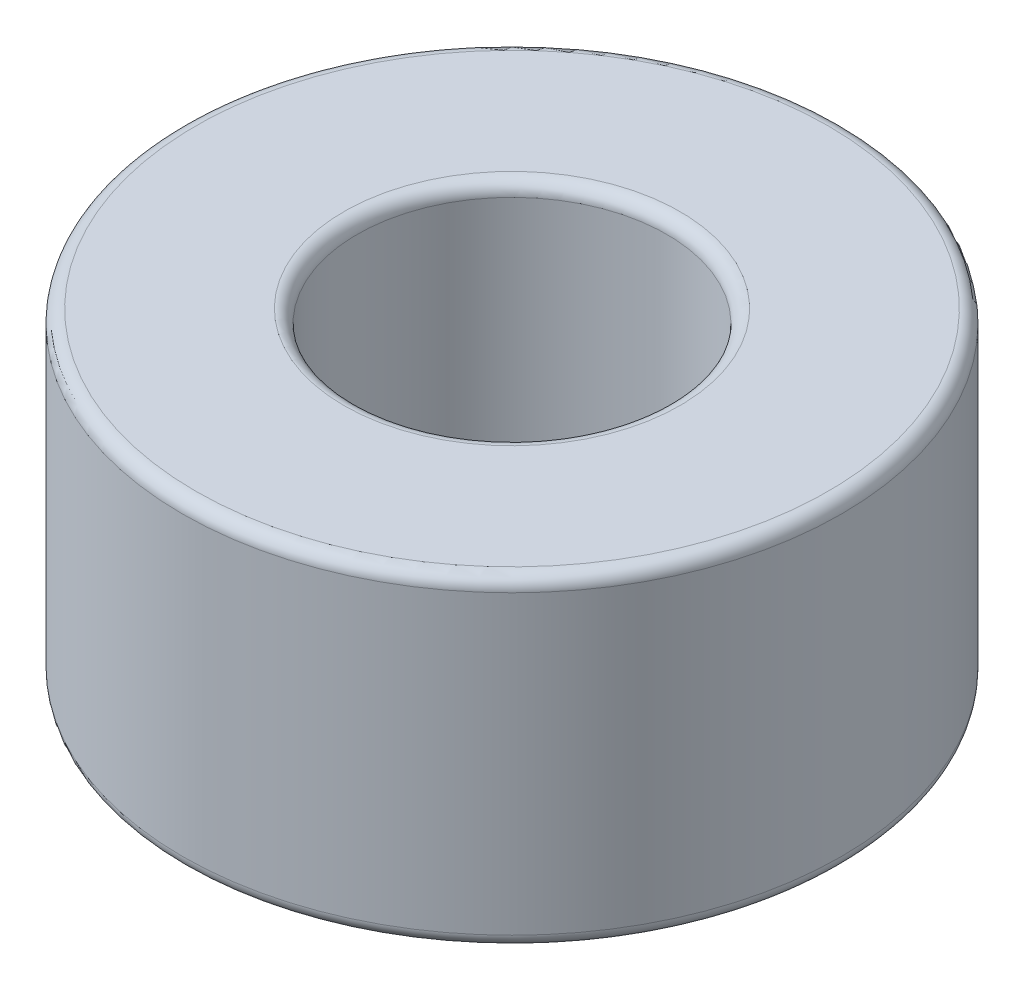
ISO-10303-21;
HEADER;
FILE_DESCRIPTION(('STEP AP214'),'2;1');
FILE_NAME('part.step','',(''),(''),'','','');
FILE_SCHEMA(('AUTOMOTIVE_DESIGN { 1 0 10303 214 1 1 1 1 }'));
ENDSEC;
DATA;
#1=APPLICATION_CONTEXT('core data for automotive mechanical design processes');
#2=APPLICATION_PROTOCOL_DEFINITION('international standard','automotive_design',2000,#1);
#3=PRODUCT_CONTEXT('',#1,'mechanical');
#4=PRODUCT('Part','Part','',(#3));
#5=PRODUCT_RELATED_PRODUCT_CATEGORY('part','',(#4));
#6=PRODUCT_DEFINITION_FORMATION('','',#4);
#7=PRODUCT_DEFINITION_CONTEXT('part definition',#1,'design');
#8=PRODUCT_DEFINITION('design','',#6,#7);
#9=PRODUCT_DEFINITION_SHAPE('','',#8);
#10=(LENGTH_UNIT() NAMED_UNIT(*) SI_UNIT(.MILLI.,.METRE.));
#11=(NAMED_UNIT(*) PLANE_ANGLE_UNIT() SI_UNIT($,.RADIAN.));
#12=(NAMED_UNIT(*) SI_UNIT($,.STERADIAN.) SOLID_ANGLE_UNIT());
#13=UNCERTAINTY_MEASURE_WITH_UNIT(LENGTH_MEASURE(1.E-05),#10,'distance_accuracy_value','');
#14=(GEOMETRIC_REPRESENTATION_CONTEXT(3) GLOBAL_UNCERTAINTY_ASSIGNED_CONTEXT((#13)) GLOBAL_UNIT_ASSIGNED_CONTEXT((#10,
#11,#12)) REPRESENTATION_CONTEXT('',''));
#15=CARTESIAN_POINT('',(0.,0.,0.));
#16=DIRECTION('',(0.,0.,1.));
#17=DIRECTION('',(1.,0.,0.));
#18=AXIS2_PLACEMENT_3D('',#15,#16,#17);
#19=CARTESIAN_POINT('',(0.,6.223,0.));
#20=DIRECTION('',(0.,1.,0.));
#21=DIRECTION('',(0.,0.,1.));
#22=AXIS2_PLACEMENT_3D('',#19,#20,#21);
#23=PLANE('',#22);
#24=CARTESIAN_POINT('',(0.,6.223,0.));
#25=DIRECTION('',(0.,1.,0.));
#26=DIRECTION('',(0.,0.,1.));
#27=AXIS2_PLACEMENT_3D('',#24,#25,#26);
#28=CIRCLE('',#27,6.096);
#29=CARTESIAN_POINT('',(0.,6.223,6.096));
#30=VERTEX_POINT('',#29);
#31=EDGE_CURVE('E10',#30,#30,#28,.T.);
#32=ORIENTED_EDGE('',*,*,#31,.T.);
#33=EDGE_LOOP('',(#32));
#34=FACE_BOUND('',#33,.T.);
#35=CARTESIAN_POINT('',(0.,6.223,0.));
#36=DIRECTION('',(0.,1.,0.));
#37=DIRECTION('',(0.,0.,1.));
#38=AXIS2_PLACEMENT_3D('',#35,#36,#37);
#39=CIRCLE('',#38,3.2385);
#40=CARTESIAN_POINT('',(0.,6.223,3.2385));
#41=VERTEX_POINT('',#40);
#42=EDGE_CURVE('E39',#41,#41,#39,.F.);
#43=ORIENTED_EDGE('',*,*,#42,.T.);
#44=EDGE_LOOP('',(#43));
#45=FACE_BOUND('',#44,.T.);
#46=ADVANCED_FACE('F32',(#34,#45),#23,.T.);
#47=CARTESIAN_POINT('',(0.,0.,0.));
#48=DIRECTION('',(0.,1.,0.));
#49=DIRECTION('',(0.,0.,1.));
#50=AXIS2_PLACEMENT_3D('',#47,#48,#49);
#51=PLANE('',#50);
#52=CARTESIAN_POINT('',(0.,0.,0.));
#53=DIRECTION('',(0.,1.,0.));
#54=DIRECTION('',(0.,0.,1.));
#55=AXIS2_PLACEMENT_3D('',#52,#53,#54);
#56=CIRCLE('',#55,3.2385);
#57=CARTESIAN_POINT('',(0.,0.,3.2385));
#58=VERTEX_POINT('',#57);
#59=EDGE_CURVE('E58',#58,#58,#56,.T.);
#60=ORIENTED_EDGE('',*,*,#59,.T.);
#61=EDGE_LOOP('',(#60));
#62=FACE_BOUND('',#61,.T.);
#63=CARTESIAN_POINT('',(0.,0.,0.));
#64=DIRECTION('',(0.,1.,0.));
#65=DIRECTION('',(0.,0.,1.));
#66=AXIS2_PLACEMENT_3D('',#63,#64,#65);
#67=CIRCLE('',#66,6.096);
#68=CARTESIAN_POINT('',(0.,0.,6.096));
#69=VERTEX_POINT('',#68);
#70=EDGE_CURVE('E61',#69,#69,#67,.F.);
#71=ORIENTED_EDGE('',*,*,#70,.T.);
#72=EDGE_LOOP('',(#71));
#73=FACE_BOUND('',#72,.T.);
#74=ADVANCED_FACE('F65',(#62,#73),#51,.F.);
#75=CARTESIAN_POINT('',(0.,6.223,0.));
#76=DIRECTION('',(0.,-1.,0.));
#77=DIRECTION('',(0.,0.,-1.));
#78=AXIS2_PLACEMENT_3D('',#75,#76,#77);
#79=CYLINDRICAL_SURFACE('',#78,6.35);
#80=CARTESIAN_POINT('',(0.,0.254,0.));
#81=DIRECTION('',(0.,1.,0.));
#82=DIRECTION('',(0.,0.,1.));
#83=AXIS2_PLACEMENT_3D('',#80,#81,#82);
#84=CIRCLE('',#83,6.35);
#85=CARTESIAN_POINT('',(0.,0.254,6.35));
#86=VERTEX_POINT('',#85);
#87=EDGE_CURVE('E43',#86,#86,#84,.T.);
#88=ORIENTED_EDGE('',*,*,#87,.T.);
#89=EDGE_LOOP('',(#88));
#90=FACE_BOUND('',#89,.T.);
#91=CARTESIAN_POINT('',(0.,5.969,0.));
#92=DIRECTION('',(0.,1.,0.));
#93=DIRECTION('',(0.,0.,1.));
#94=AXIS2_PLACEMENT_3D('',#91,#92,#93);
#95=CIRCLE('',#94,6.35);
#96=CARTESIAN_POINT('',(0.,5.969,6.35));
#97=VERTEX_POINT('',#96);
#98=EDGE_CURVE('E47',#97,#97,#95,.F.);
#99=ORIENTED_EDGE('',*,*,#98,.T.);
#100=EDGE_LOOP('',(#99));
#101=FACE_BOUND('',#100,.T.);
#102=ADVANCED_FACE('F75',(#90,#101),#79,.T.);
#103=CARTESIAN_POINT('',(0.,6.223,0.));
#104=DIRECTION('',(0.,-1.,0.));
#105=DIRECTION('',(0.,0.,-1.));
#106=AXIS2_PLACEMENT_3D('',#103,#104,#105);
#107=CYLINDRICAL_SURFACE('',#106,2.9845);
#108=CARTESIAN_POINT('',(0.,0.254,0.));
#109=DIRECTION('',(0.,1.,0.));
#110=DIRECTION('',(0.,0.,1.));
#111=AXIS2_PLACEMENT_3D('',#108,#109,#110);
#112=CIRCLE('',#111,2.9845);
#113=CARTESIAN_POINT('',(0.,0.254,2.9845));
#114=VERTEX_POINT('',#113);
#115=EDGE_CURVE('E52',#114,#114,#112,.F.);
#116=ORIENTED_EDGE('',*,*,#115,.T.);
#117=EDGE_LOOP('',(#116));
#118=FACE_BOUND('',#117,.T.);
#119=CARTESIAN_POINT('',(0.,5.969,0.));
#120=DIRECTION('',(0.,1.,0.));
#121=DIRECTION('',(0.,0.,1.));
#122=AXIS2_PLACEMENT_3D('',#119,#120,#121);
#123=CIRCLE('',#122,2.9845);
#124=CARTESIAN_POINT('',(0.,5.969,2.9845));
#125=VERTEX_POINT('',#124);
#126=EDGE_CURVE('E55',#125,#125,#123,.T.);
#127=ORIENTED_EDGE('',*,*,#126,.T.);
#128=EDGE_LOOP('',(#127));
#129=FACE_BOUND('',#128,.T.);
#130=ADVANCED_FACE('F78',(#118,#129),#107,.F.);
#131=CARTESIAN_POINT('',(0.,0.254,0.));
#132=DIRECTION('',(0.,1.,0.));
#133=DIRECTION('',(0.,0.,1.));
#134=AXIS2_PLACEMENT_3D('',#131,#132,#133);
#135=TOROIDAL_SURFACE('',#134,3.2385,0.254);
#136=ORIENTED_EDGE('',*,*,#115,.F.);
#137=EDGE_LOOP('',(#136));
#138=FACE_BOUND('',#137,.T.);
#139=ORIENTED_EDGE('',*,*,#59,.F.);
#140=EDGE_LOOP('',(#139));
#141=FACE_BOUND('',#140,.T.);
#142=ADVANCED_FACE('F71',(#138,#141),#135,.T.);
#143=CARTESIAN_POINT('',(0.,0.254,0.));
#144=DIRECTION('',(0.,1.,0.));
#145=DIRECTION('',(0.,0.,1.));
#146=AXIS2_PLACEMENT_3D('',#143,#144,#145);
#147=TOROIDAL_SURFACE('',#146,6.096,0.254);
#148=ORIENTED_EDGE('',*,*,#70,.F.);
#149=EDGE_LOOP('',(#148));
#150=FACE_BOUND('',#149,.T.);
#151=ORIENTED_EDGE('',*,*,#87,.F.);
#152=EDGE_LOOP('',(#151));
#153=FACE_BOUND('',#152,.T.);
#154=ADVANCED_FACE('F67',(#150,#153),#147,.T.);
#155=CARTESIAN_POINT('',(0.,5.969,0.));
#156=DIRECTION('',(0.,1.,0.));
#157=DIRECTION('',(0.,0.,1.));
#158=AXIS2_PLACEMENT_3D('',#155,#156,#157);
#159=TOROIDAL_SURFACE('',#158,6.096,0.254);
#160=ORIENTED_EDGE('',*,*,#98,.F.);
#161=EDGE_LOOP('',(#160));
#162=FACE_BOUND('',#161,.T.);
#163=ORIENTED_EDGE('',*,*,#31,.F.);
#164=EDGE_LOOP('',(#163));
#165=FACE_BOUND('',#164,.T.);
#166=ADVANCED_FACE('F70',(#162,#165),#159,.T.);
#167=CARTESIAN_POINT('',(0.,5.969,0.));
#168=DIRECTION('',(0.,1.,0.));
#169=DIRECTION('',(0.,0.,1.));
#170=AXIS2_PLACEMENT_3D('',#167,#168,#169);
#171=TOROIDAL_SURFACE('',#170,3.2385,0.254);
#172=ORIENTED_EDGE('',*,*,#42,.F.);
#173=EDGE_LOOP('',(#172));
#174=FACE_BOUND('',#173,.T.);
#175=ORIENTED_EDGE('',*,*,#126,.F.);
#176=EDGE_LOOP('',(#175));
#177=FACE_BOUND('',#176,.T.);
#178=ADVANCED_FACE('F34',(#174,#177),#171,.T.);
#179=CLOSED_SHELL('',(#46,#74,#102,#130,#142,#154,#166,#178));
#180=MANIFOLD_SOLID_BREP('B2',#179);
#181=ADVANCED_BREP_SHAPE_REPRESENTATION('',(#18,#180),#14);
#182=SHAPE_DEFINITION_REPRESENTATION(#9,#181);
ENDSEC;
END-ISO-10303-21;
